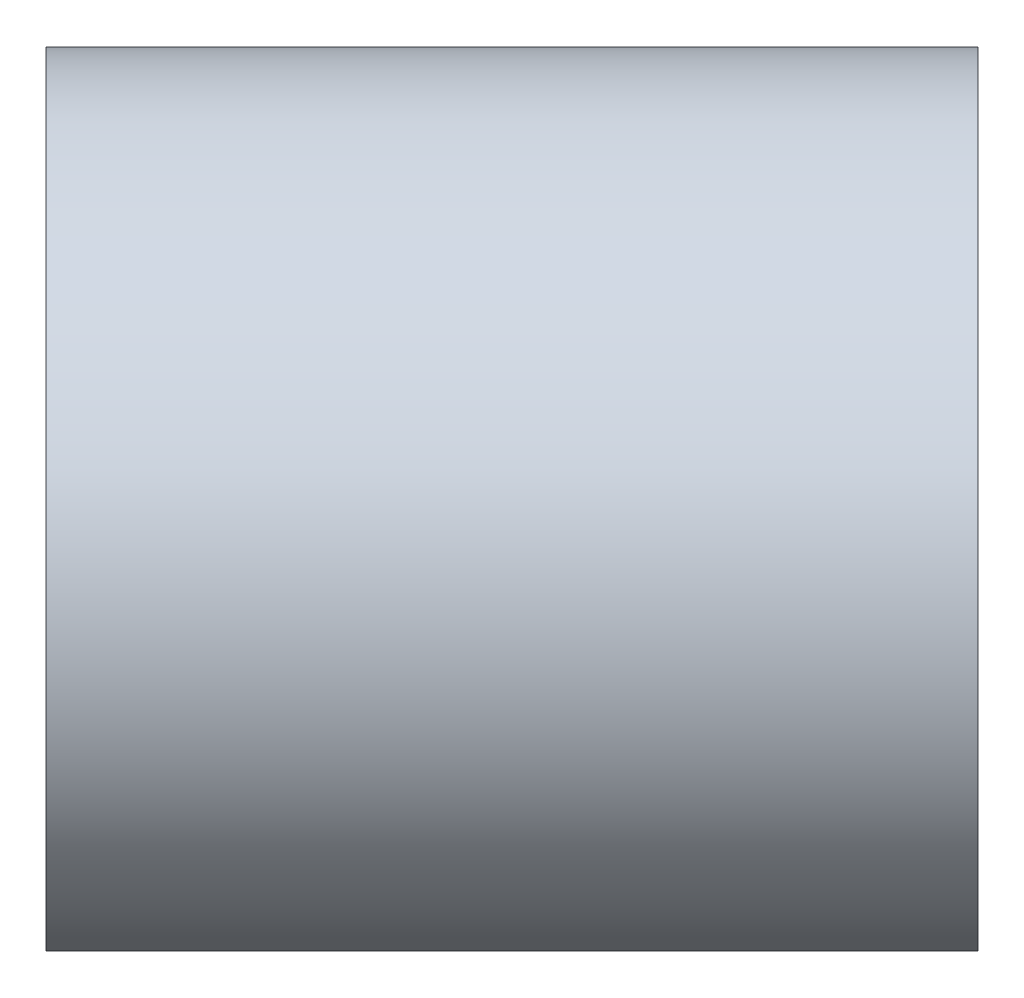
ISO-10303-21;
HEADER;
FILE_DESCRIPTION(('STEP AP214'),'2;1');
FILE_NAME('part.step','',(''),(''),'','','');
FILE_SCHEMA(('AUTOMOTIVE_DESIGN { 1 0 10303 214 1 1 1 1 }'));
ENDSEC;
DATA;
#1=APPLICATION_CONTEXT('core data for automotive mechanical design processes');
#2=APPLICATION_PROTOCOL_DEFINITION('international standard','automotive_design',2000,#1);
#3=PRODUCT_CONTEXT('',#1,'mechanical');
#4=PRODUCT('Part','Part','',(#3));
#5=PRODUCT_RELATED_PRODUCT_CATEGORY('part','',(#4));
#6=PRODUCT_DEFINITION_FORMATION('','',#4);
#7=PRODUCT_DEFINITION_CONTEXT('part definition',#1,'design');
#8=PRODUCT_DEFINITION('design','',#6,#7);
#9=PRODUCT_DEFINITION_SHAPE('','',#8);
#10=(LENGTH_UNIT() NAMED_UNIT(*) SI_UNIT(.MILLI.,.METRE.));
#11=(NAMED_UNIT(*) PLANE_ANGLE_UNIT() SI_UNIT($,.RADIAN.));
#12=(NAMED_UNIT(*) SI_UNIT($,.STERADIAN.) SOLID_ANGLE_UNIT());
#13=UNCERTAINTY_MEASURE_WITH_UNIT(LENGTH_MEASURE(1.E-05),#10,'distance_accuracy_value','');
#14=(GEOMETRIC_REPRESENTATION_CONTEXT(3) GLOBAL_UNCERTAINTY_ASSIGNED_CONTEXT((#13)) GLOBAL_UNIT_ASSIGNED_CONTEXT((#10,
#11,#12)) REPRESENTATION_CONTEXT('',''));
#15=CARTESIAN_POINT('',(0.,0.,0.));
#16=DIRECTION('',(0.,0.,1.));
#17=DIRECTION('',(1.,0.,0.));
#18=AXIS2_PLACEMENT_3D('',#15,#16,#17);
#19=CARTESIAN_POINT('',(-310.487188391881,-7.5,-479.3623285481));
#20=DIRECTION('',(0.707106781186552,0.,-0.707106781186543));
#21=DIRECTION('',(-0.707106781186543,0.,-0.707106781186552));
#22=AXIS2_PLACEMENT_3D('',#19,#20,#21);
#23=CYLINDRICAL_SURFACE('',#22,48.9999999999991);
#24=CARTESIAN_POINT('',(-310.487188391881,-7.5,-479.3623285481));
#25=DIRECTION('',(0.707106781186552,0.,-0.707106781186543));
#26=DIRECTION('',(-0.707106781186543,0.,-0.707106781186552));
#27=AXIS2_PLACEMENT_3D('',#24,#25,#26);
#28=CIRCLE('',#27,48.9999999999991);
#29=CARTESIAN_POINT('',(-345.135420670021,-7.5,-514.010560826241));
#30=VERTEX_POINT('',#29);
#31=EDGE_CURVE('E10',#30,#30,#28,.T.);
#32=ORIENTED_EDGE('',*,*,#31,.T.);
#33=EDGE_LOOP('',(#32));
#34=FACE_BOUND('',#33,.T.);
#35=CARTESIAN_POINT('',(-239.069403492039,-7.5,-550.780113447941));
#36=DIRECTION('',(0.707106781186552,0.,-0.707106781186543));
#37=DIRECTION('',(-0.707106781186543,0.,-0.707106781186552));
#38=AXIS2_PLACEMENT_3D('',#35,#36,#37);
#39=CIRCLE('',#38,48.9999999999991);
#40=CARTESIAN_POINT('',(-273.717635770179,-7.5,-585.428345726082));
#41=VERTEX_POINT('',#40);
#42=EDGE_CURVE('E34',#41,#41,#39,.T.);
#43=ORIENTED_EDGE('',*,*,#42,.F.);
#44=EDGE_LOOP('',(#43));
#45=FACE_BOUND('',#44,.T.);
#46=ADVANCED_FACE('F31',(#34,#45),#23,.T.);
#47=CARTESIAN_POINT('',(-310.487188391881,-7.5,-479.3623285481));
#48=DIRECTION('',(0.707106781186552,0.,-0.707106781186543));
#49=DIRECTION('',(-0.707106781186543,0.,-0.707106781186552));
#50=AXIS2_PLACEMENT_3D('',#47,#48,#49);
#51=PLANE('',#50);
#52=ORIENTED_EDGE('',*,*,#31,.F.);
#53=EDGE_LOOP('',(#52));
#54=FACE_BOUND('',#53,.T.);
#55=ADVANCED_FACE('F46',(#54),#51,.F.);
#56=CARTESIAN_POINT('',(-239.069403492039,-7.5,-550.780113447941));
#57=DIRECTION('',(0.707106781186552,0.,-0.707106781186543));
#58=DIRECTION('',(-0.707106781186543,0.,-0.707106781186552));
#59=AXIS2_PLACEMENT_3D('',#56,#57,#58);
#60=PLANE('',#59);
#61=ORIENTED_EDGE('',*,*,#42,.T.);
#62=EDGE_LOOP('',(#61));
#63=FACE_BOUND('',#62,.T.);
#64=ADVANCED_FACE('F43',(#63),#60,.T.);
#65=CLOSED_SHELL('',(#46,#55,#64));
#66=MANIFOLD_SOLID_BREP('B2',#65);
#67=ADVANCED_BREP_SHAPE_REPRESENTATION('',(#18,#66),#14);
#68=SHAPE_DEFINITION_REPRESENTATION(#9,#67);
ENDSEC;
END-ISO-10303-21;
